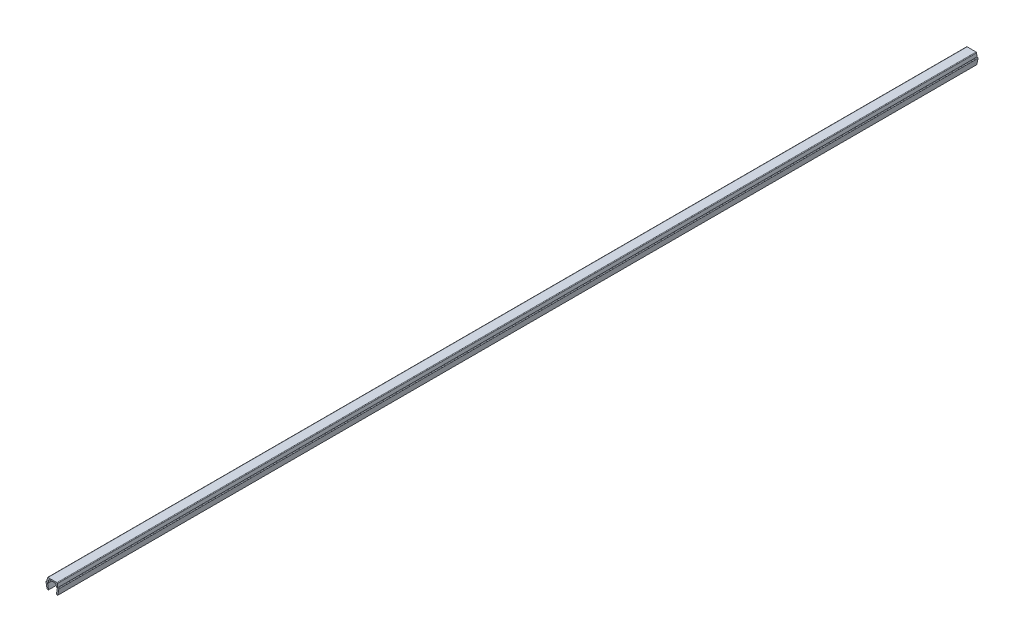
ISO-10303-21;
HEADER;
FILE_DESCRIPTION(('STEP AP214'),'2;1');
FILE_NAME('part.step','',(''),(''),'','','');
FILE_SCHEMA(('AUTOMOTIVE_DESIGN { 1 0 10303 214 1 1 1 1 }'));
ENDSEC;
DATA;
#1=APPLICATION_CONTEXT('core data for automotive mechanical design processes');
#2=APPLICATION_PROTOCOL_DEFINITION('international standard','automotive_design',2000,#1);
#3=PRODUCT_CONTEXT('',#1,'mechanical');
#4=PRODUCT('Part','Part','',(#3));
#5=PRODUCT_RELATED_PRODUCT_CATEGORY('part','',(#4));
#6=PRODUCT_DEFINITION_FORMATION('','',#4);
#7=PRODUCT_DEFINITION_CONTEXT('part definition',#1,'design');
#8=PRODUCT_DEFINITION('design','',#6,#7);
#9=PRODUCT_DEFINITION_SHAPE('','',#8);
#10=(LENGTH_UNIT() NAMED_UNIT(*) SI_UNIT(.MILLI.,.METRE.));
#11=(NAMED_UNIT(*) PLANE_ANGLE_UNIT() SI_UNIT($,.RADIAN.));
#12=(NAMED_UNIT(*) SI_UNIT($,.STERADIAN.) SOLID_ANGLE_UNIT());
#13=UNCERTAINTY_MEASURE_WITH_UNIT(LENGTH_MEASURE(1.E-05),#10,'distance_accuracy_value','');
#14=(GEOMETRIC_REPRESENTATION_CONTEXT(3) GLOBAL_UNCERTAINTY_ASSIGNED_CONTEXT((#13)) GLOBAL_UNIT_ASSIGNED_CONTEXT((#10,
#11,#12)) REPRESENTATION_CONTEXT('',''));
#15=CARTESIAN_POINT('',(0.,0.,0.));
#16=DIRECTION('',(0.,0.,1.));
#17=DIRECTION('',(1.,0.,0.));
#18=AXIS2_PLACEMENT_3D('',#15,#16,#17);
#19=CARTESIAN_POINT('',(-3.25000000000003,3.35000000000003,257.5));
#20=DIRECTION('',(0.,0.,-1.));
#21=DIRECTION('',(-1.,0.,0.));
#22=AXIS2_PLACEMENT_3D('',#19,#20,#21);
#23=CYLINDRICAL_SURFACE('',#22,0.349999999999972);
#24=DIRECTION('',(0.,0.,-1.));
#25=VECTOR('',#24,1.);
#26=CARTESIAN_POINT('',(-3.25,3.7,257.5));
#27=LINE('',#26,#25);
#28=CARTESIAN_POINT('',(-3.25,3.7,257.5));
#29=VERTEX_POINT('',#28);
#30=CARTESIAN_POINT('',(-3.25,3.7,-257.5));
#31=VERTEX_POINT('',#30);
#32=EDGE_CURVE('E211',#29,#31,#27,.T.);
#33=ORIENTED_EDGE('',*,*,#32,.T.);
#34=CARTESIAN_POINT('',(-3.25000000000003,3.35000000000003,-257.5));
#35=DIRECTION('',(0.,0.,1.));
#36=DIRECTION('',(1.,0.,0.));
#37=AXIS2_PLACEMENT_3D('',#34,#35,#36);
#38=CIRCLE('',#37,0.349999999999972);
#39=CARTESIAN_POINT('',(-3.6,3.35,-257.5));
#40=VERTEX_POINT('',#39);
#41=EDGE_CURVE('E205',#31,#40,#38,.T.);
#42=ORIENTED_EDGE('',*,*,#41,.T.);
#43=DIRECTION('',(0.,0.,-1.));
#44=VECTOR('',#43,1.);
#45=CARTESIAN_POINT('',(-3.6,3.35,257.5));
#46=LINE('',#45,#44);
#47=CARTESIAN_POINT('',(-3.6,3.35,257.5));
#48=VERTEX_POINT('',#47);
#49=EDGE_CURVE('E11',#48,#40,#46,.T.);
#50=ORIENTED_EDGE('',*,*,#49,.F.);
#51=CARTESIAN_POINT('',(-3.25000000000003,3.35000000000003,257.5));
#52=DIRECTION('',(0.,0.,1.));
#53=DIRECTION('',(1.,0.,0.));
#54=AXIS2_PLACEMENT_3D('',#51,#52,#53);
#55=CIRCLE('',#54,0.349999999999972);
#56=EDGE_CURVE('E277',#29,#48,#55,.T.);
#57=ORIENTED_EDGE('',*,*,#56,.F.);
#58=EDGE_LOOP('',(#33,#42,#50,#57));
#59=FACE_BOUND('',#58,.T.);
#60=ADVANCED_FACE('F33',(#59),#23,.T.);
#61=CARTESIAN_POINT('',(-3.6,3.35,257.5));
#62=DIRECTION('',(0.984336643247304,0.176299100283099,0.));
#63=DIRECTION('',(-0.176299100283099,0.984336643247304,0.));
#64=AXIS2_PLACEMENT_3D('',#61,#62,#63);
#65=PLANE('',#64);
#66=ORIENTED_EDGE('',*,*,#49,.T.);
#67=DIRECTION('',(0.176299100283099,-0.984336643247304,0.));
#68=VECTOR('',#67,1.);
#69=CARTESIAN_POINT('',(-3.6,3.35,-257.5));
#70=LINE('',#69,#68);
#71=CARTESIAN_POINT('',(-3.,0.,-257.5));
#72=VERTEX_POINT('',#71);
#73=EDGE_CURVE('E195',#40,#72,#70,.T.);
#74=ORIENTED_EDGE('',*,*,#73,.T.);
#75=DIRECTION('',(0.,0.,-1.));
#76=VECTOR('',#75,1.);
#77=CARTESIAN_POINT('',(-3.,0.,257.5));
#78=LINE('',#77,#76);
#79=CARTESIAN_POINT('',(-3.,0.,257.5));
#80=VERTEX_POINT('',#79);
#81=EDGE_CURVE('E40',#80,#72,#78,.T.);
#82=ORIENTED_EDGE('',*,*,#81,.F.);
#83=DIRECTION('',(0.176299100283099,-0.984336643247304,0.));
#84=VECTOR('',#83,1.);
#85=CARTESIAN_POINT('',(-3.6,3.35,257.5));
#86=LINE('',#85,#84);
#87=EDGE_CURVE('E196',#48,#80,#86,.T.);
#88=ORIENTED_EDGE('',*,*,#87,.F.);
#89=EDGE_LOOP('',(#66,#74,#82,#88));
#90=FACE_BOUND('',#89,.T.);
#91=ADVANCED_FACE('F193',(#90),#65,.F.);
#92=CARTESIAN_POINT('',(-3.,0.,257.5));
#93=DIRECTION('',(0.,1.,0.));
#94=DIRECTION('',(0.,0.,1.));
#95=AXIS2_PLACEMENT_3D('',#92,#93,#94);
#96=PLANE('',#95);
#97=ORIENTED_EDGE('',*,*,#81,.T.);
#98=DIRECTION('',(1.,0.,0.));
#99=VECTOR('',#98,1.);
#100=CARTESIAN_POINT('',(-3.,0.,-257.5));
#101=LINE('',#100,#99);
#102=CARTESIAN_POINT('',(-2.2,0.,-257.5));
#103=VERTEX_POINT('',#102);
#104=EDGE_CURVE('E209',#72,#103,#101,.T.);
#105=ORIENTED_EDGE('',*,*,#104,.T.);
#106=DIRECTION('',(0.,0.,-1.));
#107=VECTOR('',#106,1.);
#108=CARTESIAN_POINT('',(-2.2,0.,257.5));
#109=LINE('',#108,#107);
#110=CARTESIAN_POINT('',(-2.2,0.,257.5));
#111=VERTEX_POINT('',#110);
#112=EDGE_CURVE('E363',#111,#103,#109,.T.);
#113=ORIENTED_EDGE('',*,*,#112,.F.);
#114=DIRECTION('',(1.,0.,0.));
#115=VECTOR('',#114,1.);
#116=CARTESIAN_POINT('',(-3.,0.,257.5));
#117=LINE('',#116,#115);
#118=EDGE_CURVE('E280',#80,#111,#117,.T.);
#119=ORIENTED_EDGE('',*,*,#118,.F.);
#120=EDGE_LOOP('',(#97,#105,#113,#119));
#121=FACE_BOUND('',#120,.T.);
#122=ADVANCED_FACE('F366',(#121),#96,.F.);
#123=CARTESIAN_POINT('',(-2.2,0.,257.5));
#124=DIRECTION('',(-0.984336643247306,-0.176299100283088,0.));
#125=DIRECTION('',(0.176299100283088,-0.984336643247306,0.));
#126=AXIS2_PLACEMENT_3D('',#123,#124,#125);
#127=PLANE('',#126);
#128=ORIENTED_EDGE('',*,*,#112,.T.);
#129=DIRECTION('',(-0.176299100283088,0.984336643247306,0.));
#130=VECTOR('',#129,1.);
#131=CARTESIAN_POINT('',(-2.2,0.,-257.5));
#132=LINE('',#131,#130);
#133=CARTESIAN_POINT('',(-2.7352170713255,2.9882953149009,-257.5));
#134=VERTEX_POINT('',#133);
#135=EDGE_CURVE('E215',#103,#134,#132,.T.);
#136=ORIENTED_EDGE('',*,*,#135,.T.);
#137=DIRECTION('',(0.,0.,-1.));
#138=VECTOR('',#137,1.);
#139=CARTESIAN_POINT('',(-2.7352170713255,2.9882953149009,257.5));
#140=LINE('',#139,#138);
#141=CARTESIAN_POINT('',(-2.7352170713255,2.9882953149009,257.5));
#142=VERTEX_POINT('',#141);
#143=EDGE_CURVE('E361',#142,#134,#140,.T.);
#144=ORIENTED_EDGE('',*,*,#143,.F.);
#145=DIRECTION('',(-0.176299100283088,0.984336643247306,0.));
#146=VECTOR('',#145,1.);
#147=CARTESIAN_POINT('',(-2.2,0.,257.5));
#148=LINE('',#147,#146);
#149=EDGE_CURVE('E282',#111,#142,#148,.T.);
#150=ORIENTED_EDGE('',*,*,#149,.F.);
#151=EDGE_LOOP('',(#128,#136,#144,#150));
#152=FACE_BOUND('',#151,.T.);
#153=ADVANCED_FACE('F374',(#152),#127,.F.);
#154=CARTESIAN_POINT('',(-2.390699246189,3.05000000000004,257.5));
#155=DIRECTION('',(0.,0.,-1.));
#156=DIRECTION('',(-1.,0.,0.));
#157=AXIS2_PLACEMENT_3D('',#154,#155,#156);
#158=CYLINDRICAL_SURFACE('',#157,0.349999999999955);
#159=ORIENTED_EDGE('',*,*,#143,.T.);
#160=CARTESIAN_POINT('',(-2.390699246189,3.05000000000004,-257.5));
#161=DIRECTION('',(0.,0.,-1.));
#162=DIRECTION('',(-1.,0.,0.));
#163=AXIS2_PLACEMENT_3D('',#160,#161,#162);
#164=CIRCLE('',#163,0.349999999999955);
#165=CARTESIAN_POINT('',(-2.390699246189,3.4,-257.5));
#166=VERTEX_POINT('',#165);
#167=EDGE_CURVE('E218',#134,#166,#164,.T.);
#168=ORIENTED_EDGE('',*,*,#167,.T.);
#169=DIRECTION('',(0.,0.,-1.));
#170=VECTOR('',#169,1.);
#171=CARTESIAN_POINT('',(-2.390699246189,3.4,257.5));
#172=LINE('',#171,#170);
#173=CARTESIAN_POINT('',(-2.390699246189,3.4,257.5));
#174=VERTEX_POINT('',#173);
#175=EDGE_CURVE('E359',#174,#166,#172,.T.);
#176=ORIENTED_EDGE('',*,*,#175,.F.);
#177=CARTESIAN_POINT('',(-2.390699246189,3.05000000000004,257.5));
#178=DIRECTION('',(0.,0.,-1.));
#179=DIRECTION('',(-1.,0.,0.));
#180=AXIS2_PLACEMENT_3D('',#177,#178,#179);
#181=CIRCLE('',#180,0.349999999999955);
#182=EDGE_CURVE('E284',#142,#174,#181,.T.);
#183=ORIENTED_EDGE('',*,*,#182,.F.);
#184=EDGE_LOOP('',(#159,#168,#176,#183));
#185=FACE_BOUND('',#184,.T.);
#186=ADVANCED_FACE('F377',(#185),#158,.F.);
#187=CARTESIAN_POINT('',(-2.390699246189,3.4,257.5));
#188=DIRECTION('',(0.,1.,0.));
#189=DIRECTION('',(0.,0.,1.));
#190=AXIS2_PLACEMENT_3D('',#187,#188,#189);
#191=PLANE('',#190);
#192=ORIENTED_EDGE('',*,*,#175,.T.);
#193=DIRECTION('',(1.,0.,0.));
#194=VECTOR('',#193,1.);
#195=CARTESIAN_POINT('',(-2.390699246189,3.4,-257.5));
#196=LINE('',#195,#194);
#197=CARTESIAN_POINT('',(-2.2,3.4,-257.5));
#198=VERTEX_POINT('',#197);
#199=EDGE_CURVE('E221',#166,#198,#196,.T.);
#200=ORIENTED_EDGE('',*,*,#199,.T.);
#201=DIRECTION('',(0.,0.,-1.));
#202=VECTOR('',#201,1.);
#203=CARTESIAN_POINT('',(-2.2,3.4,257.5));
#204=LINE('',#203,#202);
#205=CARTESIAN_POINT('',(-2.2,3.4,257.5));
#206=VERTEX_POINT('',#205);
#207=EDGE_CURVE('E357',#206,#198,#204,.T.);
#208=ORIENTED_EDGE('',*,*,#207,.F.);
#209=DIRECTION('',(1.,0.,0.));
#210=VECTOR('',#209,1.);
#211=CARTESIAN_POINT('',(-2.390699246189,3.4,257.5));
#212=LINE('',#211,#210);
#213=EDGE_CURVE('E286',#174,#206,#212,.T.);
#214=ORIENTED_EDGE('',*,*,#213,.F.);
#215=EDGE_LOOP('',(#192,#200,#208,#214));
#216=FACE_BOUND('',#215,.T.);
#217=ADVANCED_FACE('F382',(#216),#191,.F.);
#218=CARTESIAN_POINT('',(-2.2,3.4,257.5));
#219=DIRECTION('',(-0.996194698091743,0.08715574274769,0.));
#220=DIRECTION('',(-0.08715574274769,-0.996194698091743,0.));
#221=AXIS2_PLACEMENT_3D('',#218,#219,#220);
#222=PLANE('',#221);
#223=ORIENTED_EDGE('',*,*,#207,.T.);
#224=DIRECTION('',(0.08715574274769,0.996194698091743,0.));
#225=VECTOR('',#224,1.);
#226=CARTESIAN_POINT('',(-2.2,3.4,-257.5));
#227=LINE('',#226,#225);
#228=CARTESIAN_POINT('',(-2.0704726390793,4.8805045099617,-257.5));
#229=VERTEX_POINT('',#228);
#230=EDGE_CURVE('E224',#198,#229,#227,.T.);
#231=ORIENTED_EDGE('',*,*,#230,.T.);
#232=DIRECTION('',(0.,0.,-1.));
#233=VECTOR('',#232,1.);
#234=CARTESIAN_POINT('',(-2.0704726390793,4.8805045099617,257.5));
#235=LINE('',#234,#233);
#236=CARTESIAN_POINT('',(-2.0704726390793,4.8805045099617,257.5));
#237=VERTEX_POINT('',#236);
#238=EDGE_CURVE('E355',#237,#229,#235,.T.);
#239=ORIENTED_EDGE('',*,*,#238,.F.);
#240=DIRECTION('',(0.08715574274769,0.996194698091743,0.));
#241=VECTOR('',#240,1.);
#242=CARTESIAN_POINT('',(-2.2,3.4,257.5));
#243=LINE('',#242,#241);
#244=EDGE_CURVE('E288',#206,#237,#243,.T.);
#245=ORIENTED_EDGE('',*,*,#244,.F.);
#246=EDGE_LOOP('',(#223,#231,#239,#245));
#247=FACE_BOUND('',#246,.T.);
#248=ADVANCED_FACE('F388',(#247),#222,.F.);
#249=CARTESIAN_POINT('',(-1.72180449474716,4.84999999999996,257.5));
#250=DIRECTION('',(0.,0.,-1.));
#251=DIRECTION('',(-1.,0.,0.));
#252=AXIS2_PLACEMENT_3D('',#249,#250,#251);
#253=CYLINDRICAL_SURFACE('',#252,0.350000000000036);
#254=ORIENTED_EDGE('',*,*,#238,.T.);
#255=CARTESIAN_POINT('',(-1.72180449474716,4.84999999999996,-257.5));
#256=DIRECTION('',(0.,0.,-1.));
#257=DIRECTION('',(-1.,0.,0.));
#258=AXIS2_PLACEMENT_3D('',#255,#256,#257);
#259=CIRCLE('',#258,0.350000000000036);
#260=CARTESIAN_POINT('',(-1.7218044947472,5.2,-257.5));
#261=VERTEX_POINT('',#260);
#262=EDGE_CURVE('E227',#229,#261,#259,.T.);
#263=ORIENTED_EDGE('',*,*,#262,.T.);
#264=DIRECTION('',(0.,0.,-1.));
#265=VECTOR('',#264,1.);
#266=CARTESIAN_POINT('',(-1.7218044947472,5.2,257.5));
#267=LINE('',#266,#265);
#268=CARTESIAN_POINT('',(-1.7218044947472,5.2,257.5));
#269=VERTEX_POINT('',#268);
#270=EDGE_CURVE('E353',#269,#261,#267,.T.);
#271=ORIENTED_EDGE('',*,*,#270,.F.);
#272=CARTESIAN_POINT('',(-1.72180449474716,4.84999999999996,257.5));
#273=DIRECTION('',(0.,0.,-1.));
#274=DIRECTION('',(-1.,0.,0.));
#275=AXIS2_PLACEMENT_3D('',#272,#273,#274);
#276=CIRCLE('',#275,0.350000000000036);
#277=EDGE_CURVE('E290',#237,#269,#276,.T.);
#278=ORIENTED_EDGE('',*,*,#277,.F.);
#279=EDGE_LOOP('',(#254,#263,#271,#278));
#280=FACE_BOUND('',#279,.T.);
#281=ADVANCED_FACE('F392',(#280),#253,.F.);
#282=CARTESIAN_POINT('',(-1.7218044947472,5.2,257.5));
#283=DIRECTION('',(0.,1.,0.));
#284=DIRECTION('',(0.,0.,1.));
#285=AXIS2_PLACEMENT_3D('',#282,#283,#284);
#286=PLANE('',#285);
#287=ORIENTED_EDGE('',*,*,#270,.T.);
#288=DIRECTION('',(1.,0.,0.));
#289=VECTOR('',#288,1.);
#290=CARTESIAN_POINT('',(-1.7218044947472,5.2,-257.5));
#291=LINE('',#290,#289);
#292=CARTESIAN_POINT('',(1.7218044947472,5.2,-257.5));
#293=VERTEX_POINT('',#292);
#294=EDGE_CURVE('E230',#261,#293,#291,.T.);
#295=ORIENTED_EDGE('',*,*,#294,.T.);
#296=DIRECTION('',(0.,0.,-1.));
#297=VECTOR('',#296,1.);
#298=CARTESIAN_POINT('',(1.7218044947472,5.2,257.5));
#299=LINE('',#298,#297);
#300=CARTESIAN_POINT('',(1.7218044947472,5.2,257.5));
#301=VERTEX_POINT('',#300);
#302=EDGE_CURVE('E351',#301,#293,#299,.T.);
#303=ORIENTED_EDGE('',*,*,#302,.F.);
#304=DIRECTION('',(1.,0.,0.));
#305=VECTOR('',#304,1.);
#306=CARTESIAN_POINT('',(-1.7218044947472,5.2,257.5));
#307=LINE('',#306,#305);
#308=EDGE_CURVE('E292',#269,#301,#307,.T.);
#309=ORIENTED_EDGE('',*,*,#308,.F.);
#310=EDGE_LOOP('',(#287,#295,#303,#309));
#311=FACE_BOUND('',#310,.T.);
#312=ADVANCED_FACE('F397',(#311),#286,.F.);
#313=CARTESIAN_POINT('',(1.72180449474716,4.84999999999996,257.5));
#314=DIRECTION('',(0.,0.,-1.));
#315=DIRECTION('',(-1.,0.,0.));
#316=AXIS2_PLACEMENT_3D('',#313,#314,#315);
#317=CYLINDRICAL_SURFACE('',#316,0.350000000000036);
#318=ORIENTED_EDGE('',*,*,#302,.T.);
#319=CARTESIAN_POINT('',(1.72180449474716,4.84999999999996,-257.5));
#320=DIRECTION('',(0.,0.,-1.));
#321=DIRECTION('',(-1.,0.,0.));
#322=AXIS2_PLACEMENT_3D('',#319,#320,#321);
#323=CIRCLE('',#322,0.350000000000036);
#324=CARTESIAN_POINT('',(2.0704726390793,4.8805045099617,-257.5));
#325=VERTEX_POINT('',#324);
#326=EDGE_CURVE('E233',#293,#325,#323,.T.);
#327=ORIENTED_EDGE('',*,*,#326,.T.);
#328=DIRECTION('',(0.,0.,-1.));
#329=VECTOR('',#328,1.);
#330=CARTESIAN_POINT('',(2.0704726390793,4.8805045099617,257.5));
#331=LINE('',#330,#329);
#332=CARTESIAN_POINT('',(2.0704726390793,4.8805045099617,257.5));
#333=VERTEX_POINT('',#332);
#334=EDGE_CURVE('E349',#333,#325,#331,.T.);
#335=ORIENTED_EDGE('',*,*,#334,.F.);
#336=CARTESIAN_POINT('',(1.72180449474716,4.84999999999996,257.5));
#337=DIRECTION('',(0.,0.,-1.));
#338=DIRECTION('',(-1.,0.,0.));
#339=AXIS2_PLACEMENT_3D('',#336,#337,#338);
#340=CIRCLE('',#339,0.350000000000036);
#341=EDGE_CURVE('E294',#301,#333,#340,.T.);
#342=ORIENTED_EDGE('',*,*,#341,.F.);
#343=EDGE_LOOP('',(#318,#327,#335,#342));
#344=FACE_BOUND('',#343,.T.);
#345=ADVANCED_FACE('F403',(#344),#317,.F.);
#346=CARTESIAN_POINT('',(2.0704726390793,4.8805045099617,257.5));
#347=DIRECTION('',(0.996194698091743,0.08715574274769,0.));
#348=DIRECTION('',(-0.08715574274769,0.996194698091743,0.));
#349=AXIS2_PLACEMENT_3D('',#346,#347,#348);
#350=PLANE('',#349);
#351=ORIENTED_EDGE('',*,*,#334,.T.);
#352=DIRECTION('',(0.08715574274769,-0.996194698091743,0.));
#353=VECTOR('',#352,1.);
#354=CARTESIAN_POINT('',(2.0704726390793,4.8805045099617,-257.5));
#355=LINE('',#354,#353);
#356=CARTESIAN_POINT('',(2.2,3.4,-257.5));
#357=VERTEX_POINT('',#356);
#358=EDGE_CURVE('E236',#325,#357,#355,.T.);
#359=ORIENTED_EDGE('',*,*,#358,.T.);
#360=DIRECTION('',(0.,0.,-1.));
#361=VECTOR('',#360,1.);
#362=CARTESIAN_POINT('',(2.2,3.4,257.5));
#363=LINE('',#362,#361);
#364=CARTESIAN_POINT('',(2.2,3.4,257.5));
#365=VERTEX_POINT('',#364);
#366=EDGE_CURVE('E347',#365,#357,#363,.T.);
#367=ORIENTED_EDGE('',*,*,#366,.F.);
#368=DIRECTION('',(0.08715574274769,-0.996194698091743,0.));
#369=VECTOR('',#368,1.);
#370=CARTESIAN_POINT('',(2.0704726390793,4.8805045099617,257.5));
#371=LINE('',#370,#369);
#372=EDGE_CURVE('E296',#333,#365,#371,.T.);
#373=ORIENTED_EDGE('',*,*,#372,.F.);
#374=EDGE_LOOP('',(#351,#359,#367,#373));
#375=FACE_BOUND('',#374,.T.);
#376=ADVANCED_FACE('F407',(#375),#350,.F.);
#377=CARTESIAN_POINT('',(2.2,3.4,257.5));
#378=DIRECTION('',(0.,1.,0.));
#379=DIRECTION('',(0.,0.,1.));
#380=AXIS2_PLACEMENT_3D('',#377,#378,#379);
#381=PLANE('',#380);
#382=ORIENTED_EDGE('',*,*,#366,.T.);
#383=DIRECTION('',(1.,0.,0.));
#384=VECTOR('',#383,1.);
#385=CARTESIAN_POINT('',(2.2,3.4,-257.5));
#386=LINE('',#385,#384);
#387=CARTESIAN_POINT('',(2.390699246189,3.4,-257.5));
#388=VERTEX_POINT('',#387);
#389=EDGE_CURVE('E239',#357,#388,#386,.T.);
#390=ORIENTED_EDGE('',*,*,#389,.T.);
#391=DIRECTION('',(0.,0.,-1.));
#392=VECTOR('',#391,1.);
#393=CARTESIAN_POINT('',(2.390699246189,3.4,257.5));
#394=LINE('',#393,#392);
#395=CARTESIAN_POINT('',(2.390699246189,3.4,257.5));
#396=VERTEX_POINT('',#395);
#397=EDGE_CURVE('E345',#396,#388,#394,.T.);
#398=ORIENTED_EDGE('',*,*,#397,.F.);
#399=DIRECTION('',(1.,0.,0.));
#400=VECTOR('',#399,1.);
#401=CARTESIAN_POINT('',(2.2,3.4,257.5));
#402=LINE('',#401,#400);
#403=EDGE_CURVE('E298',#365,#396,#402,.T.);
#404=ORIENTED_EDGE('',*,*,#403,.F.);
#405=EDGE_LOOP('',(#382,#390,#398,#404));
#406=FACE_BOUND('',#405,.T.);
#407=ADVANCED_FACE('F412',(#406),#381,.F.);
#408=CARTESIAN_POINT('',(2.390699246189,3.05000000000004,257.5));
#409=DIRECTION('',(0.,0.,-1.));
#410=DIRECTION('',(-1.,0.,0.));
#411=AXIS2_PLACEMENT_3D('',#408,#409,#410);
#412=CYLINDRICAL_SURFACE('',#411,0.349999999999955);
#413=ORIENTED_EDGE('',*,*,#397,.T.);
#414=CARTESIAN_POINT('',(2.390699246189,3.05000000000004,-257.5));
#415=DIRECTION('',(0.,0.,-1.));
#416=DIRECTION('',(-1.,0.,0.));
#417=AXIS2_PLACEMENT_3D('',#414,#415,#416);
#418=CIRCLE('',#417,0.349999999999955);
#419=CARTESIAN_POINT('',(2.7352170713255,2.9882953149009,-257.5));
#420=VERTEX_POINT('',#419);
#421=EDGE_CURVE('E242',#388,#420,#418,.T.);
#422=ORIENTED_EDGE('',*,*,#421,.T.);
#423=DIRECTION('',(0.,0.,-1.));
#424=VECTOR('',#423,1.);
#425=CARTESIAN_POINT('',(2.7352170713255,2.9882953149009,257.5));
#426=LINE('',#425,#424);
#427=CARTESIAN_POINT('',(2.7352170713255,2.9882953149009,257.5));
#428=VERTEX_POINT('',#427);
#429=EDGE_CURVE('E343',#428,#420,#426,.T.);
#430=ORIENTED_EDGE('',*,*,#429,.F.);
#431=CARTESIAN_POINT('',(2.390699246189,3.05000000000004,257.5));
#432=DIRECTION('',(0.,0.,-1.));
#433=DIRECTION('',(-1.,0.,0.));
#434=AXIS2_PLACEMENT_3D('',#431,#432,#433);
#435=CIRCLE('',#434,0.349999999999955);
#436=EDGE_CURVE('E300',#396,#428,#435,.T.);
#437=ORIENTED_EDGE('',*,*,#436,.F.);
#438=EDGE_LOOP('',(#413,#422,#430,#437));
#439=FACE_BOUND('',#438,.T.);
#440=ADVANCED_FACE('F418',(#439),#412,.F.);
#441=CARTESIAN_POINT('',(2.7352170713255,2.9882953149009,257.5));
#442=DIRECTION('',(0.984336643247306,-0.176299100283088,0.));
#443=DIRECTION('',(0.176299100283088,0.984336643247306,0.));
#444=AXIS2_PLACEMENT_3D('',#441,#442,#443);
#445=PLANE('',#444);
#446=ORIENTED_EDGE('',*,*,#429,.T.);
#447=DIRECTION('',(-0.176299100283088,-0.984336643247306,0.));
#448=VECTOR('',#447,1.);
#449=CARTESIAN_POINT('',(2.7352170713255,2.9882953149009,-257.5));
#450=LINE('',#449,#448);
#451=CARTESIAN_POINT('',(2.2,0.,-257.5));
#452=VERTEX_POINT('',#451);
#453=EDGE_CURVE('E245',#420,#452,#450,.T.);
#454=ORIENTED_EDGE('',*,*,#453,.T.);
#455=DIRECTION('',(0.,0.,-1.));
#456=VECTOR('',#455,1.);
#457=CARTESIAN_POINT('',(2.2,0.,257.5));
#458=LINE('',#457,#456);
#459=CARTESIAN_POINT('',(2.2,0.,257.5));
#460=VERTEX_POINT('',#459);
#461=EDGE_CURVE('E341',#460,#452,#458,.T.);
#462=ORIENTED_EDGE('',*,*,#461,.F.);
#463=DIRECTION('',(-0.176299100283088,-0.984336643247306,0.));
#464=VECTOR('',#463,1.);
#465=CARTESIAN_POINT('',(2.7352170713255,2.9882953149009,257.5));
#466=LINE('',#465,#464);
#467=EDGE_CURVE('E302',#428,#460,#466,.T.);
#468=ORIENTED_EDGE('',*,*,#467,.F.);
#469=EDGE_LOOP('',(#446,#454,#462,#468));
#470=FACE_BOUND('',#469,.T.);
#471=ADVANCED_FACE('F422',(#470),#445,.F.);
#472=CARTESIAN_POINT('',(2.2,0.,257.5));
#473=DIRECTION('',(0.,1.,0.));
#474=DIRECTION('',(0.,0.,1.));
#475=AXIS2_PLACEMENT_3D('',#472,#473,#474);
#476=PLANE('',#475);
#477=ORIENTED_EDGE('',*,*,#461,.T.);
#478=DIRECTION('',(1.,0.,0.));
#479=VECTOR('',#478,1.);
#480=CARTESIAN_POINT('',(2.2,0.,-257.5));
#481=LINE('',#480,#479);
#482=CARTESIAN_POINT('',(3.,0.,-257.5));
#483=VERTEX_POINT('',#482);
#484=EDGE_CURVE('E248',#452,#483,#481,.T.);
#485=ORIENTED_EDGE('',*,*,#484,.T.);
#486=DIRECTION('',(0.,0.,-1.));
#487=VECTOR('',#486,1.);
#488=CARTESIAN_POINT('',(3.,0.,257.5));
#489=LINE('',#488,#487);
#490=CARTESIAN_POINT('',(3.,0.,257.5));
#491=VERTEX_POINT('',#490);
#492=EDGE_CURVE('E339',#491,#483,#489,.T.);
#493=ORIENTED_EDGE('',*,*,#492,.F.);
#494=DIRECTION('',(1.,0.,0.));
#495=VECTOR('',#494,1.);
#496=CARTESIAN_POINT('',(2.2,0.,257.5));
#497=LINE('',#496,#495);
#498=EDGE_CURVE('E304',#460,#491,#497,.T.);
#499=ORIENTED_EDGE('',*,*,#498,.F.);
#500=EDGE_LOOP('',(#477,#485,#493,#499));
#501=FACE_BOUND('',#500,.T.);
#502=ADVANCED_FACE('F427',(#501),#476,.F.);
#503=CARTESIAN_POINT('',(3.,0.,257.5));
#504=DIRECTION('',(-0.984336643247304,0.176299100283099,0.));
#505=DIRECTION('',(-0.176299100283099,-0.984336643247304,0.));
#506=AXIS2_PLACEMENT_3D('',#503,#504,#505);
#507=PLANE('',#506);
#508=ORIENTED_EDGE('',*,*,#492,.T.);
#509=DIRECTION('',(0.176299100283099,0.984336643247304,0.));
#510=VECTOR('',#509,1.);
#511=CARTESIAN_POINT('',(3.,0.,-257.5));
#512=LINE('',#511,#510);
#513=CARTESIAN_POINT('',(3.6,3.35,-257.5));
#514=VERTEX_POINT('',#513);
#515=EDGE_CURVE('E251',#483,#514,#512,.T.);
#516=ORIENTED_EDGE('',*,*,#515,.T.);
#517=DIRECTION('',(0.,0.,-1.));
#518=VECTOR('',#517,1.);
#519=CARTESIAN_POINT('',(3.6,3.35,257.5));
#520=LINE('',#519,#518);
#521=CARTESIAN_POINT('',(3.6,3.35,257.5));
#522=VERTEX_POINT('',#521);
#523=EDGE_CURVE('E337',#522,#514,#520,.T.);
#524=ORIENTED_EDGE('',*,*,#523,.F.);
#525=DIRECTION('',(0.176299100283099,0.984336643247304,0.));
#526=VECTOR('',#525,1.);
#527=CARTESIAN_POINT('',(3.,0.,257.5));
#528=LINE('',#527,#526);
#529=EDGE_CURVE('E306',#491,#522,#528,.T.);
#530=ORIENTED_EDGE('',*,*,#529,.F.);
#531=EDGE_LOOP('',(#508,#516,#524,#530));
#532=FACE_BOUND('',#531,.T.);
#533=ADVANCED_FACE('F433',(#532),#507,.F.);
#534=CARTESIAN_POINT('',(3.25000000000003,3.35000000000003,257.5));
#535=DIRECTION('',(0.,0.,-1.));
#536=DIRECTION('',(-1.,0.,0.));
#537=AXIS2_PLACEMENT_3D('',#534,#535,#536);
#538=CYLINDRICAL_SURFACE('',#537,0.349999999999972);
#539=ORIENTED_EDGE('',*,*,#523,.T.);
#540=CARTESIAN_POINT('',(3.25000000000003,3.35000000000003,-257.5));
#541=DIRECTION('',(0.,0.,1.));
#542=DIRECTION('',(1.,0.,0.));
#543=AXIS2_PLACEMENT_3D('',#540,#541,#542);
#544=CIRCLE('',#543,0.349999999999972);
#545=CARTESIAN_POINT('',(3.25,3.7,-257.5));
#546=VERTEX_POINT('',#545);
#547=EDGE_CURVE('E254',#514,#546,#544,.T.);
#548=ORIENTED_EDGE('',*,*,#547,.T.);
#549=DIRECTION('',(0.,0.,-1.));
#550=VECTOR('',#549,1.);
#551=CARTESIAN_POINT('',(3.25,3.7,257.5));
#552=LINE('',#551,#550);
#553=CARTESIAN_POINT('',(3.25,3.7,257.5));
#554=VERTEX_POINT('',#553);
#555=EDGE_CURVE('E335',#554,#546,#552,.T.);
#556=ORIENTED_EDGE('',*,*,#555,.F.);
#557=CARTESIAN_POINT('',(3.25000000000003,3.35000000000003,257.5));
#558=DIRECTION('',(0.,0.,1.));
#559=DIRECTION('',(1.,0.,0.));
#560=AXIS2_PLACEMENT_3D('',#557,#558,#559);
#561=CIRCLE('',#560,0.349999999999972);
#562=EDGE_CURVE('E308',#522,#554,#561,.T.);
#563=ORIENTED_EDGE('',*,*,#562,.F.);
#564=EDGE_LOOP('',(#539,#548,#556,#563));
#565=FACE_BOUND('',#564,.T.);
#566=ADVANCED_FACE('F437',(#565),#538,.T.);
#567=CARTESIAN_POINT('',(3.25,3.7,257.5));
#568=DIRECTION('',(0.,-1.,0.));
#569=DIRECTION('',(0.,0.,-1.));
#570=AXIS2_PLACEMENT_3D('',#567,#568,#569);
#571=PLANE('',#570);
#572=ORIENTED_EDGE('',*,*,#555,.T.);
#573=DIRECTION('',(-1.,0.,0.));
#574=VECTOR('',#573,1.);
#575=CARTESIAN_POINT('',(3.25,3.7,-257.5));
#576=LINE('',#575,#574);
#577=CARTESIAN_POINT('',(3.,3.7,-257.5));
#578=VERTEX_POINT('',#577);
#579=EDGE_CURVE('E257',#546,#578,#576,.T.);
#580=ORIENTED_EDGE('',*,*,#579,.T.);
#581=DIRECTION('',(0.,0.,-1.));
#582=VECTOR('',#581,1.);
#583=CARTESIAN_POINT('',(3.,3.7,257.5));
#584=LINE('',#583,#582);
#585=CARTESIAN_POINT('',(3.,3.7,257.5));
#586=VERTEX_POINT('',#585);
#587=EDGE_CURVE('E333',#586,#578,#584,.T.);
#588=ORIENTED_EDGE('',*,*,#587,.F.);
#589=DIRECTION('',(-1.,0.,0.));
#590=VECTOR('',#589,1.);
#591=CARTESIAN_POINT('',(3.25,3.7,257.5));
#592=LINE('',#591,#590);
#593=EDGE_CURVE('E310',#554,#586,#592,.T.);
#594=ORIENTED_EDGE('',*,*,#593,.F.);
#595=EDGE_LOOP('',(#572,#580,#588,#594));
#596=FACE_BOUND('',#595,.T.);
#597=ADVANCED_FACE('F442',(#596),#571,.F.);
#598=CARTESIAN_POINT('',(3.,3.7,257.5));
#599=DIRECTION('',(-0.996194698091747,-0.0871557427476467,0.));
#600=DIRECTION('',(0.0871557427476467,-0.996194698091747,0.));
#601=AXIS2_PLACEMENT_3D('',#598,#599,#600);
#602=PLANE('',#601);
#603=ORIENTED_EDGE('',*,*,#587,.T.);
#604=DIRECTION('',(-0.0871557427476467,0.996194698091747,0.));
#605=VECTOR('',#604,1.);
#606=CARTESIAN_POINT('',(3.,3.7,-257.5));
#607=LINE('',#606,#605);
#608=CARTESIAN_POINT('',(2.835477173669,5.5805045099617,-257.5));
#609=VERTEX_POINT('',#608);
#610=EDGE_CURVE('E260',#578,#609,#607,.T.);
#611=ORIENTED_EDGE('',*,*,#610,.T.);
#612=DIRECTION('',(0.,0.,-1.));
#613=VECTOR('',#612,1.);
#614=CARTESIAN_POINT('',(2.835477173669,5.5805045099617,257.5));
#615=LINE('',#614,#613);
#616=CARTESIAN_POINT('',(2.835477173669,5.5805045099617,257.5));
#617=VERTEX_POINT('',#616);
#618=EDGE_CURVE('E331',#617,#609,#615,.T.);
#619=ORIENTED_EDGE('',*,*,#618,.F.);
#620=DIRECTION('',(-0.0871557427476467,0.996194698091747,0.));
#621=VECTOR('',#620,1.);
#622=CARTESIAN_POINT('',(3.,3.7,257.5));
#623=LINE('',#622,#621);
#624=EDGE_CURVE('E312',#586,#617,#623,.T.);
#625=ORIENTED_EDGE('',*,*,#624,.F.);
#626=EDGE_LOOP('',(#603,#611,#619,#625));
#627=FACE_BOUND('',#626,.T.);
#628=ADVANCED_FACE('F448',(#627),#602,.F.);
#629=CARTESIAN_POINT('',(2.48680902933686,5.54999999999996,257.5));
#630=DIRECTION('',(0.,0.,-1.));
#631=DIRECTION('',(-1.,0.,0.));
#632=AXIS2_PLACEMENT_3D('',#629,#630,#631);
#633=CYLINDRICAL_SURFACE('',#632,0.350000000000036);
#634=ORIENTED_EDGE('',*,*,#618,.T.);
#635=CARTESIAN_POINT('',(2.48680902933686,5.54999999999996,-257.5));
#636=DIRECTION('',(0.,0.,1.));
#637=DIRECTION('',(1.,0.,0.));
#638=AXIS2_PLACEMENT_3D('',#635,#636,#637);
#639=CIRCLE('',#638,0.350000000000036);
#640=CARTESIAN_POINT('',(2.4868090293369,5.9,-257.5));
#641=VERTEX_POINT('',#640);
#642=EDGE_CURVE('E263',#609,#641,#639,.T.);
#643=ORIENTED_EDGE('',*,*,#642,.T.);
#644=DIRECTION('',(0.,0.,-1.));
#645=VECTOR('',#644,1.);
#646=CARTESIAN_POINT('',(2.4868090293369,5.9,257.5));
#647=LINE('',#646,#645);
#648=CARTESIAN_POINT('',(2.4868090293369,5.9,257.5));
#649=VERTEX_POINT('',#648);
#650=EDGE_CURVE('E329',#649,#641,#647,.T.);
#651=ORIENTED_EDGE('',*,*,#650,.F.);
#652=CARTESIAN_POINT('',(2.48680902933686,5.54999999999996,257.5));
#653=DIRECTION('',(0.,0.,1.));
#654=DIRECTION('',(1.,0.,0.));
#655=AXIS2_PLACEMENT_3D('',#652,#653,#654);
#656=CIRCLE('',#655,0.350000000000036);
#657=EDGE_CURVE('E314',#617,#649,#656,.T.);
#658=ORIENTED_EDGE('',*,*,#657,.F.);
#659=EDGE_LOOP('',(#634,#643,#651,#658));
#660=FACE_BOUND('',#659,.T.);
#661=ADVANCED_FACE('F452',(#660),#633,.T.);
#662=CARTESIAN_POINT('',(2.4868090293369,5.9,257.5));
#663=DIRECTION('',(0.,-1.,0.));
#664=DIRECTION('',(0.,0.,-1.));
#665=AXIS2_PLACEMENT_3D('',#662,#663,#664);
#666=PLANE('',#665);
#667=ORIENTED_EDGE('',*,*,#650,.T.);
#668=DIRECTION('',(-1.,0.,0.));
#669=VECTOR('',#668,1.);
#670=CARTESIAN_POINT('',(2.4868090293369,5.9,-257.5));
#671=LINE('',#670,#669);
#672=CARTESIAN_POINT('',(-2.4868090293369,5.9,-257.5));
#673=VERTEX_POINT('',#672);
#674=EDGE_CURVE('E266',#641,#673,#671,.T.);
#675=ORIENTED_EDGE('',*,*,#674,.T.);
#676=DIRECTION('',(0.,0.,-1.));
#677=VECTOR('',#676,1.);
#678=CARTESIAN_POINT('',(-2.4868090293369,5.9,257.5));
#679=LINE('',#678,#677);
#680=CARTESIAN_POINT('',(-2.4868090293369,5.9,257.5));
#681=VERTEX_POINT('',#680);
#682=EDGE_CURVE('E327',#681,#673,#679,.T.);
#683=ORIENTED_EDGE('',*,*,#682,.F.);
#684=DIRECTION('',(-1.,0.,0.));
#685=VECTOR('',#684,1.);
#686=CARTESIAN_POINT('',(2.4868090293369,5.9,257.5));
#687=LINE('',#686,#685);
#688=EDGE_CURVE('E316',#649,#681,#687,.T.);
#689=ORIENTED_EDGE('',*,*,#688,.F.);
#690=EDGE_LOOP('',(#667,#675,#683,#689));
#691=FACE_BOUND('',#690,.T.);
#692=ADVANCED_FACE('F457',(#691),#666,.F.);
#693=CARTESIAN_POINT('',(-2.48680902933686,5.54999999999996,257.5));
#694=DIRECTION('',(0.,0.,-1.));
#695=DIRECTION('',(-1.,0.,0.));
#696=AXIS2_PLACEMENT_3D('',#693,#694,#695);
#697=CYLINDRICAL_SURFACE('',#696,0.350000000000036);
#698=ORIENTED_EDGE('',*,*,#682,.T.);
#699=CARTESIAN_POINT('',(-2.48680902933686,5.54999999999996,-257.5));
#700=DIRECTION('',(0.,0.,1.));
#701=DIRECTION('',(1.,0.,0.));
#702=AXIS2_PLACEMENT_3D('',#699,#700,#701);
#703=CIRCLE('',#702,0.350000000000036);
#704=CARTESIAN_POINT('',(-2.835477173669,5.5805045099617,-257.5));
#705=VERTEX_POINT('',#704);
#706=EDGE_CURVE('E269',#673,#705,#703,.T.);
#707=ORIENTED_EDGE('',*,*,#706,.T.);
#708=DIRECTION('',(0.,0.,-1.));
#709=VECTOR('',#708,1.);
#710=CARTESIAN_POINT('',(-2.835477173669,5.5805045099617,257.5));
#711=LINE('',#710,#709);
#712=CARTESIAN_POINT('',(-2.835477173669,5.5805045099617,257.5));
#713=VERTEX_POINT('',#712);
#714=EDGE_CURVE('E325',#713,#705,#711,.T.);
#715=ORIENTED_EDGE('',*,*,#714,.F.);
#716=CARTESIAN_POINT('',(-2.48680902933686,5.54999999999996,257.5));
#717=DIRECTION('',(0.,0.,1.));
#718=DIRECTION('',(1.,0.,0.));
#719=AXIS2_PLACEMENT_3D('',#716,#717,#718);
#720=CIRCLE('',#719,0.350000000000036);
#721=EDGE_CURVE('E318',#681,#713,#720,.T.);
#722=ORIENTED_EDGE('',*,*,#721,.F.);
#723=EDGE_LOOP('',(#698,#707,#715,#722));
#724=FACE_BOUND('',#723,.T.);
#725=ADVANCED_FACE('F461',(#724),#697,.T.);
#726=CARTESIAN_POINT('',(-2.835477173669,5.5805045099617,257.5));
#727=DIRECTION('',(0.996194698091747,-0.0871557427476467,0.));
#728=DIRECTION('',(0.0871557427476467,0.996194698091747,0.));
#729=AXIS2_PLACEMENT_3D('',#726,#727,#728);
#730=PLANE('',#729);
#731=ORIENTED_EDGE('',*,*,#714,.T.);
#732=DIRECTION('',(-0.0871557427476467,-0.996194698091747,0.));
#733=VECTOR('',#732,1.);
#734=CARTESIAN_POINT('',(-2.835477173669,5.5805045099617,-257.5));
#735=LINE('',#734,#733);
#736=CARTESIAN_POINT('',(-3.,3.7,-257.5));
#737=VERTEX_POINT('',#736);
#738=EDGE_CURVE('E272',#705,#737,#735,.T.);
#739=ORIENTED_EDGE('',*,*,#738,.T.);
#740=DIRECTION('',(0.,0.,-1.));
#741=VECTOR('',#740,1.);
#742=CARTESIAN_POINT('',(-3.,3.7,257.5));
#743=LINE('',#742,#741);
#744=CARTESIAN_POINT('',(-3.,3.7,257.5));
#745=VERTEX_POINT('',#744);
#746=EDGE_CURVE('E323',#745,#737,#743,.T.);
#747=ORIENTED_EDGE('',*,*,#746,.F.);
#748=DIRECTION('',(-0.0871557427476467,-0.996194698091747,0.));
#749=VECTOR('',#748,1.);
#750=CARTESIAN_POINT('',(-2.835477173669,5.5805045099617,257.5));
#751=LINE('',#750,#749);
#752=EDGE_CURVE('E52',#713,#745,#751,.T.);
#753=ORIENTED_EDGE('',*,*,#752,.F.);
#754=EDGE_LOOP('',(#731,#739,#747,#753));
#755=FACE_BOUND('',#754,.T.);
#756=ADVANCED_FACE('F465',(#755),#730,.F.);
#757=CARTESIAN_POINT('',(-3.,3.7,257.5));
#758=DIRECTION('',(0.,-1.,0.));
#759=DIRECTION('',(0.,0.,-1.));
#760=AXIS2_PLACEMENT_3D('',#757,#758,#759);
#761=PLANE('',#760);
#762=ORIENTED_EDGE('',*,*,#746,.T.);
#763=DIRECTION('',(-1.,0.,0.));
#764=VECTOR('',#763,1.);
#765=CARTESIAN_POINT('',(-3.,3.7,-257.5));
#766=LINE('',#765,#764);
#767=EDGE_CURVE('E275',#737,#31,#766,.T.);
#768=ORIENTED_EDGE('',*,*,#767,.T.);
#769=ORIENTED_EDGE('',*,*,#32,.F.);
#770=DIRECTION('',(-1.,0.,0.));
#771=VECTOR('',#770,1.);
#772=CARTESIAN_POINT('',(-3.,3.7,257.5));
#773=LINE('',#772,#771);
#774=EDGE_CURVE('E47',#745,#29,#773,.T.);
#775=ORIENTED_EDGE('',*,*,#774,.F.);
#776=EDGE_LOOP('',(#762,#768,#769,#775));
#777=FACE_BOUND('',#776,.T.);
#778=ADVANCED_FACE('F467',(#777),#761,.F.);
#779=CARTESIAN_POINT('',(-3.25000000000003,3.35000000000003,257.5));
#780=DIRECTION('',(0.,0.,1.));
#781=DIRECTION('',(1.,0.,0.));
#782=AXIS2_PLACEMENT_3D('',#779,#780,#781);
#783=PLANE('',#782);
#784=ORIENTED_EDGE('',*,*,#56,.T.);
#785=ORIENTED_EDGE('',*,*,#87,.T.);
#786=ORIENTED_EDGE('',*,*,#118,.T.);
#787=ORIENTED_EDGE('',*,*,#149,.T.);
#788=ORIENTED_EDGE('',*,*,#182,.T.);
#789=ORIENTED_EDGE('',*,*,#213,.T.);
#790=ORIENTED_EDGE('',*,*,#244,.T.);
#791=ORIENTED_EDGE('',*,*,#277,.T.);
#792=ORIENTED_EDGE('',*,*,#308,.T.);
#793=ORIENTED_EDGE('',*,*,#341,.T.);
#794=ORIENTED_EDGE('',*,*,#372,.T.);
#795=ORIENTED_EDGE('',*,*,#403,.T.);
#796=ORIENTED_EDGE('',*,*,#436,.T.);
#797=ORIENTED_EDGE('',*,*,#467,.T.);
#798=ORIENTED_EDGE('',*,*,#498,.T.);
#799=ORIENTED_EDGE('',*,*,#529,.T.);
#800=ORIENTED_EDGE('',*,*,#562,.T.);
#801=ORIENTED_EDGE('',*,*,#593,.T.);
#802=ORIENTED_EDGE('',*,*,#624,.T.);
#803=ORIENTED_EDGE('',*,*,#657,.T.);
#804=ORIENTED_EDGE('',*,*,#688,.T.);
#805=ORIENTED_EDGE('',*,*,#721,.T.);
#806=ORIENTED_EDGE('',*,*,#752,.T.);
#807=ORIENTED_EDGE('',*,*,#774,.T.);
#808=EDGE_LOOP('',(#784,#785,#786,#787,#788,#789,#790,#791,#792,#793,#794,#795,#796,#797,#798,
#799,#800,#801,#802,#803,#804,#805,#806,#807));
#809=FACE_BOUND('',#808,.T.);
#810=ADVANCED_FACE('F369',(#809),#783,.T.);
#811=CARTESIAN_POINT('',(-3.25000000000003,3.35000000000003,-257.5));
#812=DIRECTION('',(0.,0.,1.));
#813=DIRECTION('',(1.,0.,0.));
#814=AXIS2_PLACEMENT_3D('',#811,#812,#813);
#815=PLANE('',#814);
#816=ORIENTED_EDGE('',*,*,#41,.F.);
#817=ORIENTED_EDGE('',*,*,#767,.F.);
#818=ORIENTED_EDGE('',*,*,#738,.F.);
#819=ORIENTED_EDGE('',*,*,#706,.F.);
#820=ORIENTED_EDGE('',*,*,#674,.F.);
#821=ORIENTED_EDGE('',*,*,#642,.F.);
#822=ORIENTED_EDGE('',*,*,#610,.F.);
#823=ORIENTED_EDGE('',*,*,#579,.F.);
#824=ORIENTED_EDGE('',*,*,#547,.F.);
#825=ORIENTED_EDGE('',*,*,#515,.F.);
#826=ORIENTED_EDGE('',*,*,#484,.F.);
#827=ORIENTED_EDGE('',*,*,#453,.F.);
#828=ORIENTED_EDGE('',*,*,#421,.F.);
#829=ORIENTED_EDGE('',*,*,#389,.F.);
#830=ORIENTED_EDGE('',*,*,#358,.F.);
#831=ORIENTED_EDGE('',*,*,#326,.F.);
#832=ORIENTED_EDGE('',*,*,#294,.F.);
#833=ORIENTED_EDGE('',*,*,#262,.F.);
#834=ORIENTED_EDGE('',*,*,#230,.F.);
#835=ORIENTED_EDGE('',*,*,#199,.F.);
#836=ORIENTED_EDGE('',*,*,#167,.F.);
#837=ORIENTED_EDGE('',*,*,#135,.F.);
#838=ORIENTED_EDGE('',*,*,#104,.F.);
#839=ORIENTED_EDGE('',*,*,#73,.F.);
#840=EDGE_LOOP('',(#816,#817,#818,#819,#820,#821,#822,#823,#824,#825,#826,#827,#828,#829,#830,
#831,#832,#833,#834,#835,#836,#837,#838,#839));
#841=FACE_BOUND('',#840,.T.);
#842=ADVANCED_FACE('F203',(#841),#815,.F.);
#843=CLOSED_SHELL('',(#60,#91,#122,#153,#186,#217,#248,#281,#312,#345,#376,#407,#440,#471,#502,
#533,#566,#597,#628,#661,#692,#725,#756,#778,#810,#842));
#844=MANIFOLD_SOLID_BREP('B2',#843);
#845=ADVANCED_BREP_SHAPE_REPRESENTATION('',(#18,#844),#14);
#846=SHAPE_DEFINITION_REPRESENTATION(#9,#845);
ENDSEC;
END-ISO-10303-21;
